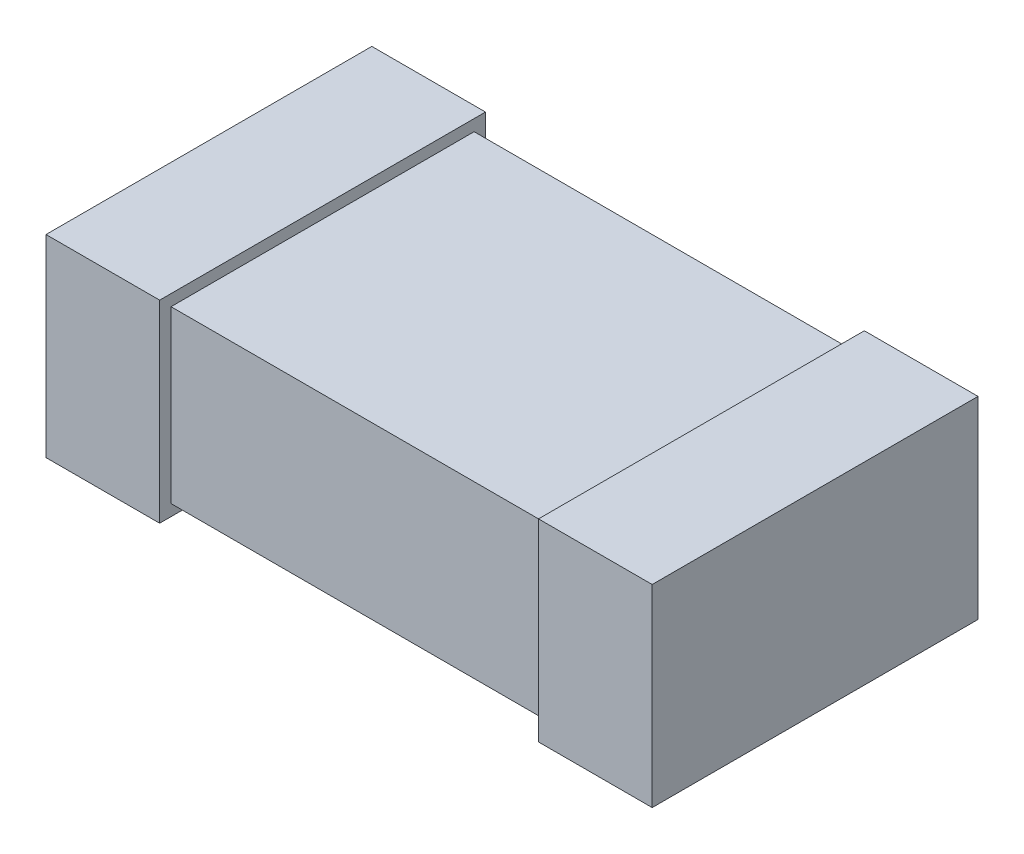
ISO-10303-21;
HEADER;
FILE_DESCRIPTION(('STEP AP214'),'2;1');
FILE_NAME('part.step','',(''),(''),'','','');
FILE_SCHEMA(('AUTOMOTIVE_DESIGN { 1 0 10303 214 1 1 1 1 }'));
ENDSEC;
DATA;
#1=APPLICATION_CONTEXT('core data for automotive mechanical design processes');
#2=APPLICATION_PROTOCOL_DEFINITION('international standard','automotive_design',2000,#1);
#3=PRODUCT_CONTEXT('',#1,'mechanical');
#4=PRODUCT('Part','Part','',(#3));
#5=PRODUCT_RELATED_PRODUCT_CATEGORY('part','',(#4));
#6=PRODUCT_DEFINITION_FORMATION('','',#4);
#7=PRODUCT_DEFINITION_CONTEXT('part definition',#1,'design');
#8=PRODUCT_DEFINITION('design','',#6,#7);
#9=PRODUCT_DEFINITION_SHAPE('','',#8);
#10=(LENGTH_UNIT() NAMED_UNIT(*) SI_UNIT(.MILLI.,.METRE.));
#11=(NAMED_UNIT(*) PLANE_ANGLE_UNIT() SI_UNIT($,.RADIAN.));
#12=(NAMED_UNIT(*) SI_UNIT($,.STERADIAN.) SOLID_ANGLE_UNIT());
#13=UNCERTAINTY_MEASURE_WITH_UNIT(LENGTH_MEASURE(1.E-05),#10,'distance_accuracy_value','');
#14=(GEOMETRIC_REPRESENTATION_CONTEXT(3) GLOBAL_UNCERTAINTY_ASSIGNED_CONTEXT((#13)) GLOBAL_UNIT_ASSIGNED_CONTEXT((#10,
#11,#12)) REPRESENTATION_CONTEXT('',''));
#15=CARTESIAN_POINT('',(0.,0.,0.));
#16=DIRECTION('',(0.,0.,1.));
#17=DIRECTION('',(1.,0.,0.));
#18=AXIS2_PLACEMENT_3D('',#15,#16,#17);
#19=CARTESIAN_POINT('',(-0.8,0.45,0.4));
#20=DIRECTION('',(0.,0.,-1.));
#21=DIRECTION('',(-1.,0.,0.));
#22=AXIS2_PLACEMENT_3D('',#19,#20,#21);
#23=PLANE('',#22);
#24=DIRECTION('',(0.,-1.,0.));
#25=VECTOR('',#24,1.);
#26=CARTESIAN_POINT('',(0.5,0.450000000000001,0.4));
#27=LINE('',#26,#25);
#28=CARTESIAN_POINT('',(0.5,0.45,0.4));
#29=VERTEX_POINT('',#28);
#30=CARTESIAN_POINT('',(0.5,0.,0.4));
#31=VERTEX_POINT('',#30);
#32=EDGE_CURVE('E53',#29,#31,#27,.T.);
#33=ORIENTED_EDGE('',*,*,#32,.F.);
#34=DIRECTION('',(1.,0.,0.));
#35=VECTOR('',#34,1.);
#36=CARTESIAN_POINT('',(-0.8,0.45,0.4));
#37=LINE('',#36,#35);
#38=CARTESIAN_POINT('',(-0.5,0.45,0.4));
#39=VERTEX_POINT('',#38);
#40=EDGE_CURVE('E218',#39,#29,#37,.T.);
#41=ORIENTED_EDGE('',*,*,#40,.F.);
#42=DIRECTION('',(0.,1.,0.));
#43=VECTOR('',#42,1.);
#44=CARTESIAN_POINT('',(-0.5,0.45,0.4));
#45=LINE('',#44,#43);
#46=CARTESIAN_POINT('',(-0.5,0.,0.4));
#47=VERTEX_POINT('',#46);
#48=EDGE_CURVE('E212',#47,#39,#45,.T.);
#49=ORIENTED_EDGE('',*,*,#48,.F.);
#50=DIRECTION('',(1.,0.,0.));
#51=VECTOR('',#50,1.);
#52=CARTESIAN_POINT('',(-0.8,0.,0.4));
#53=LINE('',#52,#51);
#54=EDGE_CURVE('E217',#47,#31,#53,.T.);
#55=ORIENTED_EDGE('',*,*,#54,.T.);
#56=EDGE_LOOP('',(#33,#41,#49,#55));
#57=FACE_BOUND('',#56,.T.);
#58=ADVANCED_FACE('F38',(#57),#23,.F.);
#59=CARTESIAN_POINT('',(-0.8,0.45,-0.4));
#60=DIRECTION('',(0.,0.,1.));
#61=DIRECTION('',(1.,0.,0.));
#62=AXIS2_PLACEMENT_3D('',#59,#60,#61);
#63=PLANE('',#62);
#64=DIRECTION('',(0.,1.,0.));
#65=VECTOR('',#64,1.);
#66=CARTESIAN_POINT('',(0.5,0.450000000000001,-0.4));
#67=LINE('',#66,#65);
#68=CARTESIAN_POINT('',(0.5,0.,-0.4));
#69=VERTEX_POINT('',#68);
#70=CARTESIAN_POINT('',(0.5,0.45,-0.4));
#71=VERTEX_POINT('',#70);
#72=EDGE_CURVE('E167',#69,#71,#67,.T.);
#73=ORIENTED_EDGE('',*,*,#72,.F.);
#74=DIRECTION('',(-1.,0.,0.));
#75=VECTOR('',#74,1.);
#76=CARTESIAN_POINT('',(-0.8,0.,-0.4));
#77=LINE('',#76,#75);
#78=CARTESIAN_POINT('',(-0.5,0.,-0.4));
#79=VERTEX_POINT('',#78);
#80=EDGE_CURVE('E221',#69,#79,#77,.T.);
#81=ORIENTED_EDGE('',*,*,#80,.T.);
#82=DIRECTION('',(0.,-1.,0.));
#83=VECTOR('',#82,1.);
#84=CARTESIAN_POINT('',(-0.5,0.45,-0.4));
#85=LINE('',#84,#83);
#86=CARTESIAN_POINT('',(-0.5,0.45,-0.4));
#87=VERTEX_POINT('',#86);
#88=EDGE_CURVE('E200',#87,#79,#85,.T.);
#89=ORIENTED_EDGE('',*,*,#88,.F.);
#90=DIRECTION('',(-1.,0.,0.));
#91=VECTOR('',#90,1.);
#92=CARTESIAN_POINT('',(-0.8,0.45,-0.4));
#93=LINE('',#92,#91);
#94=EDGE_CURVE('E220',#71,#87,#93,.T.);
#95=ORIENTED_EDGE('',*,*,#94,.F.);
#96=EDGE_LOOP('',(#73,#81,#89,#95));
#97=FACE_BOUND('',#96,.T.);
#98=ADVANCED_FACE('F238',(#97),#63,.F.);
#99=CARTESIAN_POINT('',(-0.8,0.45,0.4));
#100=DIRECTION('',(0.,1.,0.));
#101=DIRECTION('',(0.,0.,1.));
#102=AXIS2_PLACEMENT_3D('',#99,#100,#101);
#103=PLANE('',#102);
#104=ORIENTED_EDGE('',*,*,#40,.T.);
#105=DIRECTION('',(0.,0.,-1.));
#106=VECTOR('',#105,1.);
#107=CARTESIAN_POINT('',(0.5,0.45,0.4));
#108=LINE('',#107,#106);
#109=EDGE_CURVE('E60',#29,#71,#108,.T.);
#110=ORIENTED_EDGE('',*,*,#109,.T.);
#111=ORIENTED_EDGE('',*,*,#94,.T.);
#112=DIRECTION('',(0.,0.,1.));
#113=VECTOR('',#112,1.);
#114=CARTESIAN_POINT('',(-0.5,0.45,0.4));
#115=LINE('',#114,#113);
#116=EDGE_CURVE('E215',#87,#39,#115,.T.);
#117=ORIENTED_EDGE('',*,*,#116,.T.);
#118=EDGE_LOOP('',(#104,#110,#111,#117));
#119=FACE_BOUND('',#118,.T.);
#120=ADVANCED_FACE('F235',(#119),#103,.T.);
#121=CARTESIAN_POINT('',(-0.8,0.,0.4));
#122=DIRECTION('',(0.,1.,0.));
#123=DIRECTION('',(0.,0.,1.));
#124=AXIS2_PLACEMENT_3D('',#121,#122,#123);
#125=PLANE('',#124);
#126=DIRECTION('',(0.,0.,-1.));
#127=VECTOR('',#126,1.);
#128=CARTESIAN_POINT('',(0.5,0.,0.4));
#129=LINE('',#128,#127);
#130=EDGE_CURVE('E12',#31,#69,#129,.T.);
#131=ORIENTED_EDGE('',*,*,#130,.F.);
#132=ORIENTED_EDGE('',*,*,#54,.F.);
#133=DIRECTION('',(0.,0.,1.));
#134=VECTOR('',#133,1.);
#135=CARTESIAN_POINT('',(-0.5,0.,0.4));
#136=LINE('',#135,#134);
#137=EDGE_CURVE('E46',#79,#47,#136,.T.);
#138=ORIENTED_EDGE('',*,*,#137,.F.);
#139=ORIENTED_EDGE('',*,*,#80,.F.);
#140=EDGE_LOOP('',(#131,#132,#138,#139));
#141=FACE_BOUND('',#140,.T.);
#142=ADVANCED_FACE('F233',(#141),#125,.F.);
#143=CARTESIAN_POINT('',(-0.5,-0.03,1.05169248769948));
#144=DIRECTION('',(0.,1.,0.));
#145=DIRECTION('',(-1.,0.,0.));
#146=AXIS2_PLACEMENT_3D('',#143,#144,#145);
#147=PLANE('',#146);
#148=DIRECTION('',(0.,0.,-1.));
#149=VECTOR('',#148,1.);
#150=CARTESIAN_POINT('',(-0.5,-0.03,1.05169248769948));
#151=LINE('',#150,#149);
#152=CARTESIAN_POINT('',(-0.5,-0.03,0.43));
#153=VERTEX_POINT('',#152);
#154=CARTESIAN_POINT('',(-0.5,-0.03,-0.43));
#155=VERTEX_POINT('',#154);
#156=EDGE_CURVE('E189',#153,#155,#151,.T.);
#157=ORIENTED_EDGE('',*,*,#156,.F.);
#158=DIRECTION('',(-1.,0.,0.));
#159=VECTOR('',#158,1.);
#160=CARTESIAN_POINT('',(-0.5,-0.03,0.43));
#161=LINE('',#160,#159);
#162=CARTESIAN_POINT('',(-0.8,-0.03,0.43));
#163=VERTEX_POINT('',#162);
#164=EDGE_CURVE('E194',#153,#163,#161,.T.);
#165=ORIENTED_EDGE('',*,*,#164,.T.);
#166=DIRECTION('',(0.,0.,-1.));
#167=VECTOR('',#166,1.);
#168=CARTESIAN_POINT('',(-0.8,-0.03,1.05169248769948));
#169=LINE('',#168,#167);
#170=CARTESIAN_POINT('',(-0.8,-0.03,-0.43));
#171=VERTEX_POINT('',#170);
#172=EDGE_CURVE('E202',#163,#171,#169,.T.);
#173=ORIENTED_EDGE('',*,*,#172,.T.);
#174=DIRECTION('',(-1.,0.,0.));
#175=VECTOR('',#174,1.);
#176=CARTESIAN_POINT('',(-0.5,-0.03,-0.43));
#177=LINE('',#176,#175);
#178=EDGE_CURVE('E180',#155,#171,#177,.T.);
#179=ORIENTED_EDGE('',*,*,#178,.F.);
#180=EDGE_LOOP('',(#157,#165,#173,#179));
#181=FACE_BOUND('',#180,.T.);
#182=ADVANCED_FACE('F279',(#181),#147,.F.);
#183=CARTESIAN_POINT('',(-0.5,0.48,1.05169248769948));
#184=DIRECTION('',(0.,-1.,0.));
#185=DIRECTION('',(0.,0.,-1.));
#186=AXIS2_PLACEMENT_3D('',#183,#184,#185);
#187=PLANE('',#186);
#188=DIRECTION('',(0.,0.,-1.));
#189=VECTOR('',#188,1.);
#190=CARTESIAN_POINT('',(-0.8,0.48,1.05169248769948));
#191=LINE('',#190,#189);
#192=CARTESIAN_POINT('',(-0.8,0.48,0.43));
#193=VERTEX_POINT('',#192);
#194=CARTESIAN_POINT('',(-0.8,0.48,-0.43));
#195=VERTEX_POINT('',#194);
#196=EDGE_CURVE('E204',#193,#195,#191,.T.);
#197=ORIENTED_EDGE('',*,*,#196,.F.);
#198=DIRECTION('',(1.,0.,0.));
#199=VECTOR('',#198,1.);
#200=CARTESIAN_POINT('',(-0.5,0.48,0.43));
#201=LINE('',#200,#199);
#202=CARTESIAN_POINT('',(-0.5,0.48,0.43));
#203=VERTEX_POINT('',#202);
#204=EDGE_CURVE('E193',#193,#203,#201,.T.);
#205=ORIENTED_EDGE('',*,*,#204,.T.);
#206=DIRECTION('',(0.,0.,-1.));
#207=VECTOR('',#206,1.);
#208=CARTESIAN_POINT('',(-0.5,0.48,1.05169248769948));
#209=LINE('',#208,#207);
#210=CARTESIAN_POINT('',(-0.5,0.48,-0.43));
#211=VERTEX_POINT('',#210);
#212=EDGE_CURVE('E206',#203,#211,#209,.T.);
#213=ORIENTED_EDGE('',*,*,#212,.T.);
#214=DIRECTION('',(1.,0.,0.));
#215=VECTOR('',#214,1.);
#216=CARTESIAN_POINT('',(-0.5,0.48,-0.43));
#217=LINE('',#216,#215);
#218=EDGE_CURVE('E186',#195,#211,#217,.T.);
#219=ORIENTED_EDGE('',*,*,#218,.F.);
#220=EDGE_LOOP('',(#197,#205,#213,#219));
#221=FACE_BOUND('',#220,.T.);
#222=ADVANCED_FACE('F282',(#221),#187,.F.);
#223=CARTESIAN_POINT('',(-0.5,0.48,1.05169248769948));
#224=DIRECTION('',(-1.,0.,0.));
#225=DIRECTION('',(0.,0.,1.));
#226=AXIS2_PLACEMENT_3D('',#223,#224,#225);
#227=PLANE('',#226);
#228=ORIENTED_EDGE('',*,*,#116,.F.);
#229=ORIENTED_EDGE('',*,*,#88,.T.);
#230=ORIENTED_EDGE('',*,*,#137,.T.);
#231=ORIENTED_EDGE('',*,*,#48,.T.);
#232=EDGE_LOOP('',(#228,#229,#230,#231));
#233=FACE_BOUND('',#232,.T.);
#234=ORIENTED_EDGE('',*,*,#212,.F.);
#235=DIRECTION('',(0.,-1.,0.));
#236=VECTOR('',#235,1.);
#237=CARTESIAN_POINT('',(-0.5,0.48,0.43));
#238=LINE('',#237,#236);
#239=EDGE_CURVE('E197',#203,#153,#238,.T.);
#240=ORIENTED_EDGE('',*,*,#239,.T.);
#241=ORIENTED_EDGE('',*,*,#156,.T.);
#242=DIRECTION('',(0.,-1.,0.));
#243=VECTOR('',#242,1.);
#244=CARTESIAN_POINT('',(-0.5,0.48,-0.43));
#245=LINE('',#244,#243);
#246=EDGE_CURVE('E183',#211,#155,#245,.T.);
#247=ORIENTED_EDGE('',*,*,#246,.F.);
#248=EDGE_LOOP('',(#234,#240,#241,#247));
#249=FACE_BOUND('',#248,.T.);
#250=ADVANCED_FACE('F228',(#233,#249),#227,.F.);
#251=CARTESIAN_POINT('',(-0.8,0.45,0.43));
#252=DIRECTION('',(0.,0.,-1.));
#253=DIRECTION('',(-1.,0.,0.));
#254=AXIS2_PLACEMENT_3D('',#251,#252,#253);
#255=PLANE('',#254);
#256=ORIENTED_EDGE('',*,*,#204,.F.);
#257=DIRECTION('',(0.,1.,0.));
#258=VECTOR('',#257,1.);
#259=CARTESIAN_POINT('',(-0.8,0.48,0.43));
#260=LINE('',#259,#258);
#261=EDGE_CURVE('E190',#163,#193,#260,.T.);
#262=ORIENTED_EDGE('',*,*,#261,.F.);
#263=ORIENTED_EDGE('',*,*,#164,.F.);
#264=ORIENTED_EDGE('',*,*,#239,.F.);
#265=EDGE_LOOP('',(#256,#262,#263,#264));
#266=FACE_BOUND('',#265,.T.);
#267=ADVANCED_FACE('F274',(#266),#255,.F.);
#268=CARTESIAN_POINT('',(-0.8,0.45,-0.43));
#269=DIRECTION('',(0.,0.,1.));
#270=DIRECTION('',(1.,0.,0.));
#271=AXIS2_PLACEMENT_3D('',#268,#269,#270);
#272=PLANE('',#271);
#273=ORIENTED_EDGE('',*,*,#246,.T.);
#274=ORIENTED_EDGE('',*,*,#178,.T.);
#275=DIRECTION('',(0.,1.,0.));
#276=VECTOR('',#275,1.);
#277=CARTESIAN_POINT('',(-0.8,0.48,-0.43));
#278=LINE('',#277,#276);
#279=EDGE_CURVE('E177',#171,#195,#278,.T.);
#280=ORIENTED_EDGE('',*,*,#279,.T.);
#281=ORIENTED_EDGE('',*,*,#218,.T.);
#282=EDGE_LOOP('',(#273,#274,#280,#281));
#283=FACE_BOUND('',#282,.T.);
#284=ADVANCED_FACE('F271',(#283),#272,.F.);
#285=CARTESIAN_POINT('',(-0.8,0.45,-0.4));
#286=DIRECTION('',(1.,0.,0.));
#287=DIRECTION('',(0.,0.,-1.));
#288=AXIS2_PLACEMENT_3D('',#285,#286,#287);
#289=PLANE('',#288);
#290=ORIENTED_EDGE('',*,*,#172,.F.);
#291=ORIENTED_EDGE('',*,*,#261,.T.);
#292=ORIENTED_EDGE('',*,*,#196,.T.);
#293=ORIENTED_EDGE('',*,*,#279,.F.);
#294=EDGE_LOOP('',(#290,#291,#292,#293));
#295=FACE_BOUND('',#294,.T.);
#296=ADVANCED_FACE('F40',(#295),#289,.F.);
#297=CARTESIAN_POINT('',(0.5,-0.0299999999999999,1.05169248769948));
#298=DIRECTION('',(0.,1.,0.));
#299=DIRECTION('',(-1.,0.,0.));
#300=AXIS2_PLACEMENT_3D('',#297,#298,#299);
#301=PLANE('',#300);
#302=DIRECTION('',(0.,0.,-1.));
#303=VECTOR('',#302,1.);
#304=CARTESIAN_POINT('',(0.8,-0.0299999999999998,1.05169248769948));
#305=LINE('',#304,#303);
#306=CARTESIAN_POINT('',(0.8,-0.0299999999999998,0.43));
#307=VERTEX_POINT('',#306);
#308=CARTESIAN_POINT('',(0.8,-0.0299999999999998,-0.43));
#309=VERTEX_POINT('',#308);
#310=EDGE_CURVE('E140',#307,#309,#305,.T.);
#311=ORIENTED_EDGE('',*,*,#310,.F.);
#312=DIRECTION('',(-1.,0.,0.));
#313=VECTOR('',#312,1.);
#314=CARTESIAN_POINT('',(0.5,-0.0299999999999999,0.43));
#315=LINE('',#314,#313);
#316=CARTESIAN_POINT('',(0.5,-0.0299999999999999,0.43));
#317=VERTEX_POINT('',#316);
#318=EDGE_CURVE('E135',#307,#317,#315,.T.);
#319=ORIENTED_EDGE('',*,*,#318,.T.);
#320=DIRECTION('',(0.,0.,-1.));
#321=VECTOR('',#320,1.);
#322=CARTESIAN_POINT('',(0.5,-0.0299999999999999,1.05169248769948));
#323=LINE('',#322,#321);
#324=CARTESIAN_POINT('',(0.5,-0.0299999999999999,-0.43));
#325=VERTEX_POINT('',#324);
#326=EDGE_CURVE('E130',#317,#325,#323,.T.);
#327=ORIENTED_EDGE('',*,*,#326,.T.);
#328=DIRECTION('',(-1.,0.,0.));
#329=VECTOR('',#328,1.);
#330=CARTESIAN_POINT('',(0.5,-0.0299999999999999,-0.43));
#331=LINE('',#330,#329);
#332=EDGE_CURVE('E134',#309,#325,#331,.T.);
#333=ORIENTED_EDGE('',*,*,#332,.F.);
#334=EDGE_LOOP('',(#311,#319,#327,#333));
#335=FACE_BOUND('',#334,.T.);
#336=ADVANCED_FACE('F133',(#335),#301,.F.);
#337=CARTESIAN_POINT('',(0.5,0.48,1.05169248769948));
#338=DIRECTION('',(1.,0.,0.));
#339=DIRECTION('',(0.,1.,0.));
#340=AXIS2_PLACEMENT_3D('',#337,#338,#339);
#341=PLANE('',#340);
#342=ORIENTED_EDGE('',*,*,#109,.F.);
#343=ORIENTED_EDGE('',*,*,#32,.T.);
#344=ORIENTED_EDGE('',*,*,#130,.T.);
#345=ORIENTED_EDGE('',*,*,#72,.T.);
#346=EDGE_LOOP('',(#342,#343,#344,#345));
#347=FACE_BOUND('',#346,.T.);
#348=ORIENTED_EDGE('',*,*,#326,.F.);
#349=DIRECTION('',(0.,1.,0.));
#350=VECTOR('',#349,1.);
#351=CARTESIAN_POINT('',(0.5,0.48,0.43));
#352=LINE('',#351,#350);
#353=CARTESIAN_POINT('',(0.5,0.48,0.43));
#354=VERTEX_POINT('',#353);
#355=EDGE_CURVE('E162',#317,#354,#352,.T.);
#356=ORIENTED_EDGE('',*,*,#355,.T.);
#357=DIRECTION('',(0.,0.,-1.));
#358=VECTOR('',#357,1.);
#359=CARTESIAN_POINT('',(0.5,0.48,1.05169248769948));
#360=LINE('',#359,#358);
#361=CARTESIAN_POINT('',(0.5,0.48,-0.43));
#362=VERTEX_POINT('',#361);
#363=EDGE_CURVE('E139',#354,#362,#360,.T.);
#364=ORIENTED_EDGE('',*,*,#363,.T.);
#365=DIRECTION('',(0.,1.,0.));
#366=VECTOR('',#365,1.);
#367=CARTESIAN_POINT('',(0.5,0.48,-0.43));
#368=LINE('',#367,#366);
#369=EDGE_CURVE('E147',#325,#362,#368,.T.);
#370=ORIENTED_EDGE('',*,*,#369,.F.);
#371=EDGE_LOOP('',(#348,#356,#364,#370));
#372=FACE_BOUND('',#371,.T.);
#373=ADVANCED_FACE('F152',(#347,#372),#341,.F.);
#374=CARTESIAN_POINT('',(0.5,0.48,1.05169248769948));
#375=DIRECTION('',(0.,-1.,0.));
#376=DIRECTION('',(1.,0.,0.));
#377=AXIS2_PLACEMENT_3D('',#374,#375,#376);
#378=PLANE('',#377);
#379=ORIENTED_EDGE('',*,*,#363,.F.);
#380=DIRECTION('',(1.,0.,0.));
#381=VECTOR('',#380,1.);
#382=CARTESIAN_POINT('',(0.5,0.48,0.43));
#383=LINE('',#382,#381);
#384=CARTESIAN_POINT('',(0.8,0.48,0.43));
#385=VERTEX_POINT('',#384);
#386=EDGE_CURVE('E165',#354,#385,#383,.T.);
#387=ORIENTED_EDGE('',*,*,#386,.T.);
#388=DIRECTION('',(0.,0.,-1.));
#389=VECTOR('',#388,1.);
#390=CARTESIAN_POINT('',(0.8,0.48,1.05169248769948));
#391=LINE('',#390,#389);
#392=CARTESIAN_POINT('',(0.8,0.48,-0.43));
#393=VERTEX_POINT('',#392);
#394=EDGE_CURVE('E154',#385,#393,#391,.T.);
#395=ORIENTED_EDGE('',*,*,#394,.T.);
#396=DIRECTION('',(1.,0.,0.));
#397=VECTOR('',#396,1.);
#398=CARTESIAN_POINT('',(0.5,0.48,-0.43));
#399=LINE('',#398,#397);
#400=EDGE_CURVE('E155',#362,#393,#399,.T.);
#401=ORIENTED_EDGE('',*,*,#400,.F.);
#402=EDGE_LOOP('',(#379,#387,#395,#401));
#403=FACE_BOUND('',#402,.T.);
#404=ADVANCED_FACE('F258',(#403),#378,.F.);
#405=CARTESIAN_POINT('',(-0.8,0.45,0.43));
#406=DIRECTION('',(0.,0.,-1.));
#407=DIRECTION('',(-1.,0.,0.));
#408=AXIS2_PLACEMENT_3D('',#405,#406,#407);
#409=PLANE('',#408);
#410=ORIENTED_EDGE('',*,*,#355,.F.);
#411=ORIENTED_EDGE('',*,*,#318,.F.);
#412=DIRECTION('',(0.,-1.,0.));
#413=VECTOR('',#412,1.);
#414=CARTESIAN_POINT('',(0.8,0.48,0.43));
#415=LINE('',#414,#413);
#416=EDGE_CURVE('E163',#385,#307,#415,.T.);
#417=ORIENTED_EDGE('',*,*,#416,.F.);
#418=ORIENTED_EDGE('',*,*,#386,.F.);
#419=EDGE_LOOP('',(#410,#411,#417,#418));
#420=FACE_BOUND('',#419,.T.);
#421=ADVANCED_FACE('F254',(#420),#409,.F.);
#422=CARTESIAN_POINT('',(-0.8,0.45,-0.43));
#423=DIRECTION('',(0.,0.,1.));
#424=DIRECTION('',(1.,0.,0.));
#425=AXIS2_PLACEMENT_3D('',#422,#423,#424);
#426=PLANE('',#425);
#427=ORIENTED_EDGE('',*,*,#400,.T.);
#428=DIRECTION('',(0.,-1.,0.));
#429=VECTOR('',#428,1.);
#430=CARTESIAN_POINT('',(0.8,0.48,-0.43));
#431=LINE('',#430,#429);
#432=EDGE_CURVE('E150',#393,#309,#431,.T.);
#433=ORIENTED_EDGE('',*,*,#432,.T.);
#434=ORIENTED_EDGE('',*,*,#332,.T.);
#435=ORIENTED_EDGE('',*,*,#369,.T.);
#436=EDGE_LOOP('',(#427,#433,#434,#435));
#437=FACE_BOUND('',#436,.T.);
#438=ADVANCED_FACE('F146',(#437),#426,.F.);
#439=CARTESIAN_POINT('',(0.8,0.45,-0.4));
#440=DIRECTION('',(-1.,0.,0.));
#441=DIRECTION('',(0.,0.,1.));
#442=AXIS2_PLACEMENT_3D('',#439,#440,#441);
#443=PLANE('',#442);
#444=ORIENTED_EDGE('',*,*,#394,.F.);
#445=ORIENTED_EDGE('',*,*,#416,.T.);
#446=ORIENTED_EDGE('',*,*,#310,.T.);
#447=ORIENTED_EDGE('',*,*,#432,.F.);
#448=EDGE_LOOP('',(#444,#445,#446,#447));
#449=FACE_BOUND('',#448,.T.);
#450=ADVANCED_FACE('F248',(#449),#443,.F.);
#451=CLOSED_SHELL('',(#58,#98,#120,#142,#182,#222,#250,#267,#284,#296,#336,#373,#404,#421,#438,#450));
#452=MANIFOLD_SOLID_BREP('B2',#451);
#453=ADVANCED_BREP_SHAPE_REPRESENTATION('',(#18,#452),#14);
#454=SHAPE_DEFINITION_REPRESENTATION(#9,#453);
ENDSEC;
END-ISO-10303-21;
